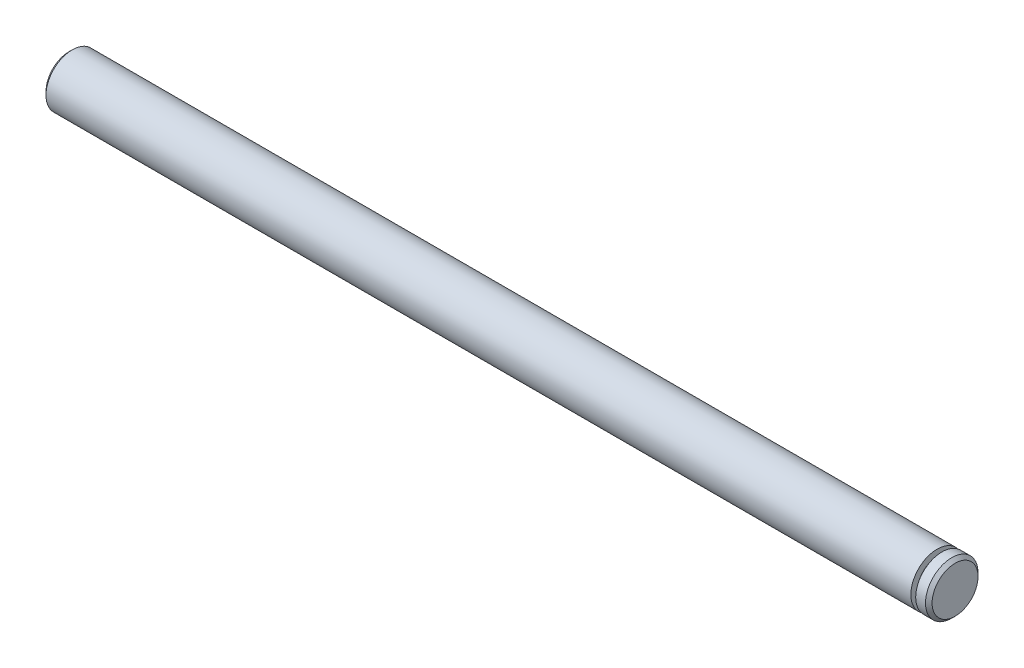
ISO-10303-21;
HEADER;
FILE_DESCRIPTION(('STEP AP214'),'2;1');
FILE_NAME('part.step','',(''),(''),'','','');
FILE_SCHEMA(('AUTOMOTIVE_DESIGN { 1 0 10303 214 1 1 1 1 }'));
ENDSEC;
DATA;
#1=APPLICATION_CONTEXT('core data for automotive mechanical design processes');
#2=APPLICATION_PROTOCOL_DEFINITION('international standard','automotive_design',2000,#1);
#3=PRODUCT_CONTEXT('',#1,'mechanical');
#4=PRODUCT('Part','Part','',(#3));
#5=PRODUCT_RELATED_PRODUCT_CATEGORY('part','',(#4));
#6=PRODUCT_DEFINITION_FORMATION('','',#4);
#7=PRODUCT_DEFINITION_CONTEXT('part definition',#1,'design');
#8=PRODUCT_DEFINITION('design','',#6,#7);
#9=PRODUCT_DEFINITION_SHAPE('','',#8);
#10=(LENGTH_UNIT() NAMED_UNIT(*) SI_UNIT(.MILLI.,.METRE.));
#11=(NAMED_UNIT(*) PLANE_ANGLE_UNIT() SI_UNIT($,.RADIAN.));
#12=(NAMED_UNIT(*) SI_UNIT($,.STERADIAN.) SOLID_ANGLE_UNIT());
#13=UNCERTAINTY_MEASURE_WITH_UNIT(LENGTH_MEASURE(1.E-05),#10,'distance_accuracy_value','');
#14=(GEOMETRIC_REPRESENTATION_CONTEXT(3) GLOBAL_UNCERTAINTY_ASSIGNED_CONTEXT((#13)) GLOBAL_UNIT_ASSIGNED_CONTEXT((#10,
#11,#12)) REPRESENTATION_CONTEXT('',''));
#15=CARTESIAN_POINT('',(0.,0.,0.));
#16=DIRECTION('',(0.,0.,1.));
#17=DIRECTION('',(1.,0.,0.));
#18=AXIS2_PLACEMENT_3D('',#15,#16,#17);
#19=CARTESIAN_POINT('',(-132.2634,0.,0.));
#20=DIRECTION('',(1.,0.,0.));
#21=DIRECTION('',(0.,0.,-1.));
#22=AXIS2_PLACEMENT_3D('',#19,#20,#21);
#23=PLANE('',#22);
#24=CARTESIAN_POINT('',(-132.2634,0.,0.));
#25=DIRECTION('',(1.,0.,0.));
#26=DIRECTION('',(0.,0.,-1.));
#27=AXIS2_PLACEMENT_3D('',#24,#25,#26);
#28=CIRCLE('',#27,3.5);
#29=CARTESIAN_POINT('',(-132.2634,0.,-3.5));
#30=VERTEX_POINT('',#29);
#31=EDGE_CURVE('E46',#30,#30,#28,.F.);
#32=ORIENTED_EDGE('',*,*,#31,.T.);
#33=EDGE_LOOP('',(#32));
#34=FACE_BOUND('',#33,.T.);
#35=ADVANCED_FACE('F31',(#34),#23,.F.);
#36=CARTESIAN_POINT('',(2.7366,0.,0.));
#37=DIRECTION('',(-1.,0.,0.));
#38=DIRECTION('',(0.,0.,1.));
#39=AXIS2_PLACEMENT_3D('',#36,#37,#38);
#40=CYLINDRICAL_SURFACE('',#39,4.);
#41=CARTESIAN_POINT('',(-131.7634,0.,0.));
#42=DIRECTION('',(1.,0.,0.));
#43=DIRECTION('',(0.,0.,-1.));
#44=AXIS2_PLACEMENT_3D('',#41,#42,#43);
#45=CIRCLE('',#44,4.);
#46=CARTESIAN_POINT('',(-131.7634,0.,-4.));
#47=VERTEX_POINT('',#46);
#48=EDGE_CURVE('E42',#47,#47,#45,.T.);
#49=ORIENTED_EDGE('',*,*,#48,.T.);
#50=EDGE_LOOP('',(#49));
#51=FACE_BOUND('',#50,.T.);
#52=CARTESIAN_POINT('',(0.,0.,0.));
#53=DIRECTION('',(-1.,0.,0.));
#54=DIRECTION('',(0.,0.,1.));
#55=AXIS2_PLACEMENT_3D('',#52,#53,#54);
#56=CIRCLE('',#55,4.);
#57=CARTESIAN_POINT('',(0.,0.,4.));
#58=VERTEX_POINT('',#57);
#59=EDGE_CURVE('E51',#58,#58,#56,.T.);
#60=ORIENTED_EDGE('',*,*,#59,.T.);
#61=EDGE_LOOP('',(#60));
#62=FACE_BOUND('',#61,.T.);
#63=ADVANCED_FACE('F80',(#51,#62),#40,.T.);
#64=CARTESIAN_POINT('',(0.,4.,0.));
#65=DIRECTION('',(-1.,0.,0.));
#66=DIRECTION('',(0.,0.,1.));
#67=AXIS2_PLACEMENT_3D('',#64,#65,#66);
#68=PLANE('',#67);
#69=ORIENTED_EDGE('',*,*,#59,.F.);
#70=EDGE_LOOP('',(#69));
#71=FACE_BOUND('',#70,.T.);
#72=CARTESIAN_POINT('',(0.,0.,0.));
#73=DIRECTION('',(-1.,0.,0.));
#74=DIRECTION('',(0.,0.,1.));
#75=AXIS2_PLACEMENT_3D('',#72,#73,#74);
#76=CIRCLE('',#75,3.);
#77=CARTESIAN_POINT('',(0.,0.,3.));
#78=VERTEX_POINT('',#77);
#79=EDGE_CURVE('E54',#78,#78,#76,.T.);
#80=ORIENTED_EDGE('',*,*,#79,.T.);
#81=EDGE_LOOP('',(#80));
#82=FACE_BOUND('',#81,.T.);
#83=ADVANCED_FACE('F86',(#71,#82),#68,.F.);
#84=CARTESIAN_POINT('',(2.7366,0.,0.));
#85=DIRECTION('',(-1.,0.,0.));
#86=DIRECTION('',(0.,0.,1.));
#87=AXIS2_PLACEMENT_3D('',#84,#85,#86);
#88=CYLINDRICAL_SURFACE('',#87,3.);
#89=ORIENTED_EDGE('',*,*,#79,.F.);
#90=EDGE_LOOP('',(#89));
#91=FACE_BOUND('',#90,.T.);
#92=CARTESIAN_POINT('',(0.7366,0.,0.));
#93=DIRECTION('',(-1.,0.,0.));
#94=DIRECTION('',(0.,0.,1.));
#95=AXIS2_PLACEMENT_3D('',#92,#93,#94);
#96=CIRCLE('',#95,3.);
#97=CARTESIAN_POINT('',(0.7366,0.,3.));
#98=VERTEX_POINT('',#97);
#99=EDGE_CURVE('E57',#98,#98,#96,.T.);
#100=ORIENTED_EDGE('',*,*,#99,.T.);
#101=EDGE_LOOP('',(#100));
#102=FACE_BOUND('',#101,.T.);
#103=ADVANCED_FACE('F76',(#91,#102),#88,.T.);
#104=CARTESIAN_POINT('',(0.7366,4.,0.));
#105=DIRECTION('',(1.,0.,0.));
#106=DIRECTION('',(0.,0.,-1.));
#107=AXIS2_PLACEMENT_3D('',#104,#105,#106);
#108=PLANE('',#107);
#109=ORIENTED_EDGE('',*,*,#99,.F.);
#110=EDGE_LOOP('',(#109));
#111=FACE_BOUND('',#110,.T.);
#112=CARTESIAN_POINT('',(0.7366,0.,0.));
#113=DIRECTION('',(-1.,0.,0.));
#114=DIRECTION('',(0.,0.,1.));
#115=AXIS2_PLACEMENT_3D('',#112,#113,#114);
#116=CIRCLE('',#115,4.);
#117=CARTESIAN_POINT('',(0.7366,0.,4.));
#118=VERTEX_POINT('',#117);
#119=EDGE_CURVE('E60',#118,#118,#116,.T.);
#120=ORIENTED_EDGE('',*,*,#119,.T.);
#121=EDGE_LOOP('',(#120));
#122=FACE_BOUND('',#121,.T.);
#123=ADVANCED_FACE('F64',(#111,#122),#108,.F.);
#124=CARTESIAN_POINT('',(2.7366,0.,0.));
#125=DIRECTION('',(-1.,0.,0.));
#126=DIRECTION('',(0.,0.,1.));
#127=AXIS2_PLACEMENT_3D('',#124,#125,#126);
#128=CYLINDRICAL_SURFACE('',#127,4.);
#129=CARTESIAN_POINT('',(2.23660000000003,0.,0.));
#130=DIRECTION('',(-1.,0.,0.));
#131=DIRECTION('',(0.,0.,1.));
#132=AXIS2_PLACEMENT_3D('',#129,#130,#131);
#133=CIRCLE('',#132,4.);
#134=CARTESIAN_POINT('',(2.23660000000003,0.,4.));
#135=VERTEX_POINT('',#134);
#136=EDGE_CURVE('E38',#135,#135,#133,.T.);
#137=ORIENTED_EDGE('',*,*,#136,.T.);
#138=EDGE_LOOP('',(#137));
#139=FACE_BOUND('',#138,.T.);
#140=ORIENTED_EDGE('',*,*,#119,.F.);
#141=EDGE_LOOP('',(#140));
#142=FACE_BOUND('',#141,.T.);
#143=ADVANCED_FACE('F66',(#139,#142),#128,.T.);
#144=CARTESIAN_POINT('',(2.7366,0.,0.));
#145=DIRECTION('',(-1.,0.,0.));
#146=DIRECTION('',(0.,0.,1.));
#147=AXIS2_PLACEMENT_3D('',#144,#145,#146);
#148=PLANE('',#147);
#149=CARTESIAN_POINT('',(2.7366,0.,0.));
#150=DIRECTION('',(-1.,0.,0.));
#151=DIRECTION('',(0.,0.,1.));
#152=AXIS2_PLACEMENT_3D('',#149,#150,#151);
#153=CIRCLE('',#152,3.50000000000003);
#154=CARTESIAN_POINT('',(2.7366,0.,3.50000000000003));
#155=VERTEX_POINT('',#154);
#156=EDGE_CURVE('E10',#155,#155,#153,.F.);
#157=ORIENTED_EDGE('',*,*,#156,.T.);
#158=EDGE_LOOP('',(#157));
#159=FACE_BOUND('',#158,.T.);
#160=ADVANCED_FACE('F68',(#159),#148,.F.);
#161=CARTESIAN_POINT('',(-132.2634,0.,0.));
#162=DIRECTION('',(1.,0.,0.));
#163=DIRECTION('',(0.,0.,-1.));
#164=AXIS2_PLACEMENT_3D('',#161,#162,#163);
#165=CONICAL_SURFACE('',#164,3.5,0.785398163397473);
#166=ORIENTED_EDGE('',*,*,#48,.F.);
#167=EDGE_LOOP('',(#166));
#168=FACE_BOUND('',#167,.T.);
#169=ORIENTED_EDGE('',*,*,#31,.F.);
#170=EDGE_LOOP('',(#169));
#171=FACE_BOUND('',#170,.T.);
#172=ADVANCED_FACE('F74',(#168,#171),#165,.T.);
#173=CARTESIAN_POINT('',(2.23660000000003,0.,0.));
#174=DIRECTION('',(-1.,0.,0.));
#175=DIRECTION('',(0.,0.,1.));
#176=AXIS2_PLACEMENT_3D('',#173,#174,#175);
#177=CONICAL_SURFACE('',#176,4.,0.785398163397448);
#178=ORIENTED_EDGE('',*,*,#156,.F.);
#179=EDGE_LOOP('',(#178));
#180=FACE_BOUND('',#179,.T.);
#181=ORIENTED_EDGE('',*,*,#136,.F.);
#182=EDGE_LOOP('',(#181));
#183=FACE_BOUND('',#182,.T.);
#184=ADVANCED_FACE('F33',(#180,#183),#177,.T.);
#185=CLOSED_SHELL('',(#35,#63,#83,#103,#123,#143,#160,#172,#184));
#186=MANIFOLD_SOLID_BREP('B2',#185);
#187=ADVANCED_BREP_SHAPE_REPRESENTATION('',(#18,#186),#14);
#188=SHAPE_DEFINITION_REPRESENTATION(#9,#187);
ENDSEC;
END-ISO-10303-21;
